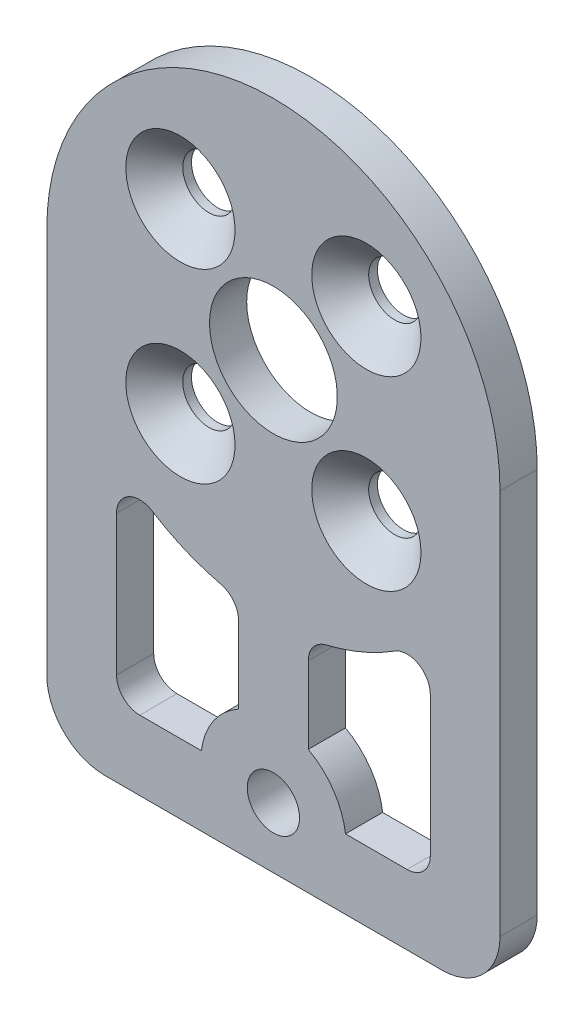
ISO-10303-21;
HEADER;
FILE_DESCRIPTION(('STEP AP214'),'2;1');
FILE_NAME('part.step','',(''),(''),'','','');
FILE_SCHEMA(('AUTOMOTIVE_DESIGN { 1 0 10303 214 1 1 1 1 }'));
ENDSEC;
DATA;
#1=APPLICATION_CONTEXT('core data for automotive mechanical design processes');
#2=APPLICATION_PROTOCOL_DEFINITION('international standard','automotive_design',2000,#1);
#3=PRODUCT_CONTEXT('',#1,'mechanical');
#4=PRODUCT('Part','Part','',(#3));
#5=PRODUCT_RELATED_PRODUCT_CATEGORY('part','',(#4));
#6=PRODUCT_DEFINITION_FORMATION('','',#4);
#7=PRODUCT_DEFINITION_CONTEXT('part definition',#1,'design');
#8=PRODUCT_DEFINITION('design','',#6,#7);
#9=PRODUCT_DEFINITION_SHAPE('','',#8);
#10=(LENGTH_UNIT() NAMED_UNIT(*) SI_UNIT(.MILLI.,.METRE.));
#11=(NAMED_UNIT(*) PLANE_ANGLE_UNIT() SI_UNIT($,.RADIAN.));
#12=(NAMED_UNIT(*) SI_UNIT($,.STERADIAN.) SOLID_ANGLE_UNIT());
#13=UNCERTAINTY_MEASURE_WITH_UNIT(LENGTH_MEASURE(1.E-05),#10,'distance_accuracy_value','');
#14=(GEOMETRIC_REPRESENTATION_CONTEXT(3) GLOBAL_UNCERTAINTY_ASSIGNED_CONTEXT((#13)) GLOBAL_UNIT_ASSIGNED_CONTEXT((#10,
#11,#12)) REPRESENTATION_CONTEXT('',''));
#15=CARTESIAN_POINT('',(0.,0.,0.));
#16=DIRECTION('',(0.,0.,1.));
#17=DIRECTION('',(1.,0.,0.));
#18=AXIS2_PLACEMENT_3D('',#15,#16,#17);
#19=CARTESIAN_POINT('',(-7.99999999999997,-8.00000000000003,-34.2));
#20=DIRECTION('',(0.,0.,1.));
#21=DIRECTION('',(1.,0.,0.));
#22=AXIS2_PLACEMENT_3D('',#19,#20,#21);
#23=CYLINDRICAL_SURFACE('',#22,2.25);
#24=CARTESIAN_POINT('',(-7.99999999999997,-8.00000000000003,-34.2));
#25=DIRECTION('',(0.,0.,-1.));
#26=DIRECTION('',(-1.,0.,0.));
#27=AXIS2_PLACEMENT_3D('',#24,#25,#26);
#28=CIRCLE('',#27,2.25);
#29=CARTESIAN_POINT('',(-10.25,-8.00000000000003,-34.2));
#30=VERTEX_POINT('',#29);
#31=EDGE_CURVE('E283',#30,#30,#28,.T.);
#32=ORIENTED_EDGE('',*,*,#31,.T.);
#33=EDGE_LOOP('',(#32));
#34=FACE_BOUND('',#33,.T.);
#35=CARTESIAN_POINT('',(-7.99999999999997,-8.00000000000003,-33.45));
#36=DIRECTION('',(0.,0.,1.));
#37=DIRECTION('',(1.,0.,0.));
#38=AXIS2_PLACEMENT_3D('',#35,#36,#37);
#39=CIRCLE('',#38,2.24999999999999);
#40=CARTESIAN_POINT('',(-5.74999999999999,-8.00000000000003,-33.45));
#41=VERTEX_POINT('',#40);
#42=EDGE_CURVE('E421',#41,#41,#39,.T.);
#43=ORIENTED_EDGE('',*,*,#42,.T.);
#44=EDGE_LOOP('',(#43));
#45=FACE_BOUND('',#44,.T.);
#46=ADVANCED_FACE('F42',(#34,#45),#23,.F.);
#47=CARTESIAN_POINT('',(8.,-8.,-34.2));
#48=DIRECTION('',(0.,0.,1.));
#49=DIRECTION('',(1.,0.,0.));
#50=AXIS2_PLACEMENT_3D('',#47,#48,#49);
#51=CYLINDRICAL_SURFACE('',#50,2.25);
#52=CARTESIAN_POINT('',(8.,-8.,-34.2));
#53=DIRECTION('',(0.,0.,-1.));
#54=DIRECTION('',(-1.,0.,0.));
#55=AXIS2_PLACEMENT_3D('',#52,#53,#54);
#56=CIRCLE('',#55,2.25);
#57=CARTESIAN_POINT('',(5.75,-8.,-34.2));
#58=VERTEX_POINT('',#57);
#59=EDGE_CURVE('E278',#58,#58,#56,.T.);
#60=ORIENTED_EDGE('',*,*,#59,.T.);
#61=EDGE_LOOP('',(#60));
#62=FACE_BOUND('',#61,.T.);
#63=CARTESIAN_POINT('',(8.,-8.,-33.45));
#64=DIRECTION('',(0.,0.,1.));
#65=DIRECTION('',(1.,0.,0.));
#66=AXIS2_PLACEMENT_3D('',#63,#64,#65);
#67=CIRCLE('',#66,2.24999999999999);
#68=CARTESIAN_POINT('',(10.25,-8.,-33.45));
#69=VERTEX_POINT('',#68);
#70=EDGE_CURVE('E415',#69,#69,#67,.T.);
#71=ORIENTED_EDGE('',*,*,#70,.T.);
#72=EDGE_LOOP('',(#71));
#73=FACE_BOUND('',#72,.T.);
#74=ADVANCED_FACE('F454',(#62,#73),#51,.F.);
#75=CARTESIAN_POINT('',(7.99999999999992,8.00000000000009,-34.2));
#76=DIRECTION('',(0.,0.,1.));
#77=DIRECTION('',(1.,0.,0.));
#78=AXIS2_PLACEMENT_3D('',#75,#76,#77);
#79=CYLINDRICAL_SURFACE('',#78,2.25);
#80=CARTESIAN_POINT('',(7.99999999999992,8.00000000000009,-34.2));
#81=DIRECTION('',(0.,0.,-1.));
#82=DIRECTION('',(-1.,0.,0.));
#83=AXIS2_PLACEMENT_3D('',#80,#81,#82);
#84=CIRCLE('',#83,2.25);
#85=CARTESIAN_POINT('',(5.74999999999992,8.00000000000009,-34.2));
#86=VERTEX_POINT('',#85);
#87=EDGE_CURVE('E271',#86,#86,#84,.T.);
#88=ORIENTED_EDGE('',*,*,#87,.T.);
#89=EDGE_LOOP('',(#88));
#90=FACE_BOUND('',#89,.T.);
#91=CARTESIAN_POINT('',(7.99999999999992,8.00000000000009,-33.45));
#92=DIRECTION('',(0.,0.,1.));
#93=DIRECTION('',(1.,0.,0.));
#94=AXIS2_PLACEMENT_3D('',#91,#92,#93);
#95=CIRCLE('',#94,2.24999999999999);
#96=CARTESIAN_POINT('',(10.2499999999999,8.00000000000009,-33.45));
#97=VERTEX_POINT('',#96);
#98=EDGE_CURVE('E409',#97,#97,#95,.T.);
#99=ORIENTED_EDGE('',*,*,#98,.T.);
#100=EDGE_LOOP('',(#99));
#101=FACE_BOUND('',#100,.T.);
#102=ADVANCED_FACE('F460',(#90,#101),#79,.F.);
#103=CARTESIAN_POINT('',(-8.,8.,-34.2));
#104=DIRECTION('',(0.,0.,1.));
#105=DIRECTION('',(1.,0.,0.));
#106=AXIS2_PLACEMENT_3D('',#103,#104,#105);
#107=CYLINDRICAL_SURFACE('',#106,2.25);
#108=CARTESIAN_POINT('',(-8.,8.,-34.2));
#109=DIRECTION('',(0.,0.,-1.));
#110=DIRECTION('',(-1.,0.,0.));
#111=AXIS2_PLACEMENT_3D('',#108,#109,#110);
#112=CIRCLE('',#111,2.25);
#113=CARTESIAN_POINT('',(-10.25,8.,-34.2));
#114=VERTEX_POINT('',#113);
#115=EDGE_CURVE('E286',#114,#114,#112,.T.);
#116=ORIENTED_EDGE('',*,*,#115,.T.);
#117=EDGE_LOOP('',(#116));
#118=FACE_BOUND('',#117,.T.);
#119=CARTESIAN_POINT('',(-8.,8.,-33.45));
#120=DIRECTION('',(0.,0.,1.));
#121=DIRECTION('',(1.,0.,0.));
#122=AXIS2_PLACEMENT_3D('',#119,#120,#121);
#123=CIRCLE('',#122,2.24999999999999);
#124=CARTESIAN_POINT('',(-5.75000000000002,8.,-33.45));
#125=VERTEX_POINT('',#124);
#126=EDGE_CURVE('E255',#125,#125,#123,.T.);
#127=ORIENTED_EDGE('',*,*,#126,.T.);
#128=EDGE_LOOP('',(#127));
#129=FACE_BOUND('',#128,.T.);
#130=ADVANCED_FACE('F432',(#118,#129),#107,.F.);
#131=CARTESIAN_POINT('',(0.,0.,-31.));
#132=DIRECTION('',(0.,0.,-1.));
#133=DIRECTION('',(-1.,0.,0.));
#134=AXIS2_PLACEMENT_3D('',#131,#132,#133);
#135=PLANE('',#134);
#136=CARTESIAN_POINT('',(-7.99999999999997,-8.00000000000003,-31.));
#137=DIRECTION('',(0.,0.,1.));
#138=DIRECTION('',(1.,0.,0.));
#139=AXIS2_PLACEMENT_3D('',#136,#137,#138);
#140=CIRCLE('',#139,4.7);
#141=CARTESIAN_POINT('',(-3.29999999999997,-8.00000000000003,-31.));
#142=VERTEX_POINT('',#141);
#143=EDGE_CURVE('E424',#142,#142,#140,.T.);
#144=ORIENTED_EDGE('',*,*,#143,.F.);
#145=EDGE_LOOP('',(#144));
#146=FACE_BOUND('',#145,.T.);
#147=CARTESIAN_POINT('',(8.,-8.,-31.));
#148=DIRECTION('',(0.,0.,1.));
#149=DIRECTION('',(1.,0.,0.));
#150=AXIS2_PLACEMENT_3D('',#147,#148,#149);
#151=CIRCLE('',#150,4.7);
#152=CARTESIAN_POINT('',(12.7,-8.,-31.));
#153=VERTEX_POINT('',#152);
#154=EDGE_CURVE('E418',#153,#153,#151,.T.);
#155=ORIENTED_EDGE('',*,*,#154,.F.);
#156=EDGE_LOOP('',(#155));
#157=FACE_BOUND('',#156,.T.);
#158=CARTESIAN_POINT('',(7.99999999999992,8.00000000000009,-31.));
#159=DIRECTION('',(0.,0.,1.));
#160=DIRECTION('',(1.,0.,0.));
#161=AXIS2_PLACEMENT_3D('',#158,#159,#160);
#162=CIRCLE('',#161,4.7);
#163=CARTESIAN_POINT('',(12.6999999999999,8.00000000000009,-31.));
#164=VERTEX_POINT('',#163);
#165=EDGE_CURVE('E412',#164,#164,#162,.T.);
#166=ORIENTED_EDGE('',*,*,#165,.F.);
#167=EDGE_LOOP('',(#166));
#168=FACE_BOUND('',#167,.T.);
#169=DIRECTION('',(0.,-1.,0.));
#170=VECTOR('',#169,1.);
#171=CARTESIAN_POINT('',(2.99999999999998,0.,-31.));
#172=LINE('',#171,#170);
#173=CARTESIAN_POINT('',(2.99999999999998,-20.9105236663265,-31.));
#174=VERTEX_POINT('',#173);
#175=CARTESIAN_POINT('',(2.99999999999998,-27.5170719501347,-31.));
#176=VERTEX_POINT('',#175);
#177=EDGE_CURVE('E227',#174,#176,#172,.T.);
#178=ORIENTED_EDGE('',*,*,#177,.F.);
#179=CARTESIAN_POINT('',(4.99999999999998,-20.9105236663265,-31.));
#180=DIRECTION('',(0.,0.,-1.));
#181=DIRECTION('',(-1.,0.,0.));
#182=AXIS2_PLACEMENT_3D('',#179,#180,#181);
#183=CIRCLE('',#182,2.);
#184=CARTESIAN_POINT('',(4.53488372093022,-18.9653586741101,-31.));
#185=VERTEX_POINT('',#184);
#186=EDGE_CURVE('E369',#174,#185,#183,.T.);
#187=ORIENTED_EDGE('',*,*,#186,.T.);
#188=CARTESIAN_POINT('',(0.,0.,-31.));
#189=DIRECTION('',(0.,0.,1.));
#190=DIRECTION('',(1.,0.,0.));
#191=AXIS2_PLACEMENT_3D('',#188,#189,#190);
#192=CIRCLE('',#191,19.5);
#193=CARTESIAN_POINT('',(10.4302325581395,-16.4760507641584,-31.));
#194=VERTEX_POINT('',#193);
#195=EDGE_CURVE('E224',#185,#194,#192,.T.);
#196=ORIENTED_EDGE('',*,*,#195,.T.);
#197=CARTESIAN_POINT('',(11.5,-18.1659021245849,-31.));
#198=DIRECTION('',(0.,0.,-1.));
#199=DIRECTION('',(-1.,0.,0.));
#200=AXIS2_PLACEMENT_3D('',#197,#198,#199);
#201=CIRCLE('',#200,2.);
#202=CARTESIAN_POINT('',(13.5,-18.1659021245849,-31.));
#203=VERTEX_POINT('',#202);
#204=EDGE_CURVE('E50',#194,#203,#201,.T.);
#205=ORIENTED_EDGE('',*,*,#204,.T.);
#206=DIRECTION('',(0.,1.,0.));
#207=VECTOR('',#206,1.);
#208=CARTESIAN_POINT('',(13.5,0.,-31.));
#209=LINE('',#208,#207);
#210=CARTESIAN_POINT('',(13.5,-30.2157287525381,-31.));
#211=VERTEX_POINT('',#210);
#212=EDGE_CURVE('E233',#211,#203,#209,.T.);
#213=ORIENTED_EDGE('',*,*,#212,.F.);
#214=CARTESIAN_POINT('',(11.5,-30.2157287525381,-31.));
#215=DIRECTION('',(0.,0.,-1.));
#216=DIRECTION('',(-1.,0.,0.));
#217=AXIS2_PLACEMENT_3D('',#214,#215,#216);
#218=CIRCLE('',#217,2.);
#219=CARTESIAN_POINT('',(11.5,-32.2157287525381,-31.));
#220=VERTEX_POINT('',#219);
#221=EDGE_CURVE('E373',#211,#220,#218,.T.);
#222=ORIENTED_EDGE('',*,*,#221,.T.);
#223=DIRECTION('',(1.,0.,0.));
#224=VECTOR('',#223,1.);
#225=CARTESIAN_POINT('',(0.,-32.2157287525381,-31.));
#226=LINE('',#225,#224);
#227=CARTESIAN_POINT('',(6.20059824616984,-32.2157287525381,-31.));
#228=VERTEX_POINT('',#227);
#229=EDGE_CURVE('E231',#228,#220,#226,.T.);
#230=ORIENTED_EDGE('',*,*,#229,.F.);
#231=CARTESIAN_POINT('',(0.,-33.,-31.));
#232=DIRECTION('',(0.,0.,1.));
#233=DIRECTION('',(1.,0.,0.));
#234=AXIS2_PLACEMENT_3D('',#231,#232,#233);
#235=CIRCLE('',#234,6.25);
#236=EDGE_CURVE('E198',#176,#228,#235,.F.);
#237=ORIENTED_EDGE('',*,*,#236,.F.);
#238=EDGE_LOOP('',(#178,#187,#196,#205,#213,#222,#230,#237));
#239=FACE_BOUND('',#238,.T.);
#240=CARTESIAN_POINT('',(0.,0.,-31.));
#241=DIRECTION('',(0.,0.,-1.));
#242=DIRECTION('',(-1.,0.,0.));
#243=AXIS2_PLACEMENT_3D('',#240,#241,#242);
#244=CIRCLE('',#243,5.5);
#245=CARTESIAN_POINT('',(-5.5,0.,-31.));
#246=VERTEX_POINT('',#245);
#247=EDGE_CURVE('E274',#246,#246,#244,.T.);
#248=ORIENTED_EDGE('',*,*,#247,.T.);
#249=EDGE_LOOP('',(#248));
#250=FACE_BOUND('',#249,.T.);
#251=DIRECTION('',(-1.,0.,0.));
#252=VECTOR('',#251,1.);
#253=CARTESIAN_POINT('',(19.5,-38.2157287525381,-31.));
#254=LINE('',#253,#252);
#255=CARTESIAN_POINT('',(14.5,-38.2157287525381,-31.));
#256=VERTEX_POINT('',#255);
#257=CARTESIAN_POINT('',(-14.5,-38.2157287525381,-31.));
#258=VERTEX_POINT('',#257);
#259=EDGE_CURVE('E308',#256,#258,#254,.T.);
#260=ORIENTED_EDGE('',*,*,#259,.F.);
#261=CARTESIAN_POINT('',(14.5,-33.2157287525381,-31.));
#262=DIRECTION('',(0.,0.,-1.));
#263=DIRECTION('',(-1.,0.,0.));
#264=AXIS2_PLACEMENT_3D('',#261,#262,#263);
#265=CIRCLE('',#264,5.);
#266=CARTESIAN_POINT('',(19.5,-33.2157287525381,-31.));
#267=VERTEX_POINT('',#266);
#268=EDGE_CURVE('E326',#256,#267,#265,.F.);
#269=ORIENTED_EDGE('',*,*,#268,.T.);
#270=DIRECTION('',(0.,-1.,0.));
#271=VECTOR('',#270,1.);
#272=CARTESIAN_POINT('',(19.5,0.,-31.));
#273=LINE('',#272,#271);
#274=CARTESIAN_POINT('',(19.5,0.,-31.));
#275=VERTEX_POINT('',#274);
#276=EDGE_CURVE('E305',#275,#267,#273,.T.);
#277=ORIENTED_EDGE('',*,*,#276,.F.);
#278=CARTESIAN_POINT('',(0.,0.,-31.));
#279=DIRECTION('',(0.,0.,-1.));
#280=DIRECTION('',(-1.,0.,0.));
#281=AXIS2_PLACEMENT_3D('',#278,#279,#280);
#282=CIRCLE('',#281,19.5);
#283=CARTESIAN_POINT('',(-19.5,0.,-31.));
#284=VERTEX_POINT('',#283);
#285=EDGE_CURVE('E289',#284,#275,#282,.T.);
#286=ORIENTED_EDGE('',*,*,#285,.F.);
#287=DIRECTION('',(0.,1.,0.));
#288=VECTOR('',#287,1.);
#289=CARTESIAN_POINT('',(-19.5,-38.2157287525381,-31.));
#290=LINE('',#289,#288);
#291=CARTESIAN_POINT('',(-19.5,-33.2157287525381,-31.));
#292=VERTEX_POINT('',#291);
#293=EDGE_CURVE('E294',#292,#284,#290,.T.);
#294=ORIENTED_EDGE('',*,*,#293,.F.);
#295=CARTESIAN_POINT('',(-14.5,-33.2157287525381,-31.));
#296=DIRECTION('',(0.,0.,-1.));
#297=DIRECTION('',(-1.,0.,0.));
#298=AXIS2_PLACEMENT_3D('',#295,#296,#297);
#299=CIRCLE('',#298,5.);
#300=EDGE_CURVE('E324',#292,#258,#299,.F.);
#301=ORIENTED_EDGE('',*,*,#300,.T.);
#302=EDGE_LOOP('',(#260,#269,#277,#286,#294,#301));
#303=FACE_BOUND('',#302,.T.);
#304=CARTESIAN_POINT('',(0.,-33.,-31.));
#305=DIRECTION('',(0.,0.,-1.));
#306=DIRECTION('',(-1.,0.,0.));
#307=AXIS2_PLACEMENT_3D('',#304,#305,#306);
#308=CIRCLE('',#307,2.25);
#309=CARTESIAN_POINT('',(-2.25000000000001,-33.,-31.));
#310=VERTEX_POINT('',#309);
#311=EDGE_CURVE('E202',#310,#310,#308,.T.);
#312=ORIENTED_EDGE('',*,*,#311,.T.);
#313=EDGE_LOOP('',(#312));
#314=FACE_BOUND('',#313,.T.);
#315=DIRECTION('',(0.,-1.,0.));
#316=VECTOR('',#315,1.);
#317=CARTESIAN_POINT('',(-13.5,0.,-31.));
#318=LINE('',#317,#316);
#319=CARTESIAN_POINT('',(-13.5,-18.1659021245849,-31.));
#320=VERTEX_POINT('',#319);
#321=CARTESIAN_POINT('',(-13.5,-30.2157287525381,-31.));
#322=VERTEX_POINT('',#321);
#323=EDGE_CURVE('E254',#320,#322,#318,.T.);
#324=ORIENTED_EDGE('',*,*,#323,.F.);
#325=CARTESIAN_POINT('',(-11.5,-18.1659021245849,-31.));
#326=DIRECTION('',(0.,0.,-1.));
#327=DIRECTION('',(-1.,0.,0.));
#328=AXIS2_PLACEMENT_3D('',#325,#326,#327);
#329=CIRCLE('',#328,2.);
#330=CARTESIAN_POINT('',(-10.4302325581395,-16.4760507641584,-31.));
#331=VERTEX_POINT('',#330);
#332=EDGE_CURVE('E380',#320,#331,#329,.T.);
#333=ORIENTED_EDGE('',*,*,#332,.T.);
#334=CARTESIAN_POINT('',(0.,0.,-31.));
#335=DIRECTION('',(0.,0.,1.));
#336=DIRECTION('',(1.,0.,0.));
#337=AXIS2_PLACEMENT_3D('',#334,#335,#336);
#338=CIRCLE('',#337,19.5);
#339=CARTESIAN_POINT('',(-4.53488372093023,-18.9653586741101,-31.));
#340=VERTEX_POINT('',#339);
#341=EDGE_CURVE('E252',#331,#340,#338,.T.);
#342=ORIENTED_EDGE('',*,*,#341,.T.);
#343=CARTESIAN_POINT('',(-5.,-20.9105236663265,-31.));
#344=DIRECTION('',(0.,0.,-1.));
#345=DIRECTION('',(-1.,0.,0.));
#346=AXIS2_PLACEMENT_3D('',#343,#344,#345);
#347=CIRCLE('',#346,2.);
#348=CARTESIAN_POINT('',(-3.,-20.9105236663265,-31.));
#349=VERTEX_POINT('',#348);
#350=EDGE_CURVE('E65',#340,#349,#347,.T.);
#351=ORIENTED_EDGE('',*,*,#350,.T.);
#352=DIRECTION('',(0.,-1.,0.));
#353=VECTOR('',#352,1.);
#354=CARTESIAN_POINT('',(-3.,0.,-31.));
#355=LINE('',#354,#353);
#356=CARTESIAN_POINT('',(-3.,-27.5170719501347,-31.));
#357=VERTEX_POINT('',#356);
#358=EDGE_CURVE('E241',#349,#357,#355,.T.);
#359=ORIENTED_EDGE('',*,*,#358,.T.);
#360=CARTESIAN_POINT('',(0.,-33.,-31.));
#361=DIRECTION('',(0.,0.,1.));
#362=DIRECTION('',(1.,0.,0.));
#363=AXIS2_PLACEMENT_3D('',#360,#361,#362);
#364=CIRCLE('',#363,6.25);
#365=CARTESIAN_POINT('',(-6.20059824616985,-32.2157287525381,-31.));
#366=VERTEX_POINT('',#365);
#367=EDGE_CURVE('E260',#366,#357,#364,.F.);
#368=ORIENTED_EDGE('',*,*,#367,.F.);
#369=DIRECTION('',(1.,0.,0.));
#370=VECTOR('',#369,1.);
#371=CARTESIAN_POINT('',(0.,-32.2157287525381,-31.));
#372=LINE('',#371,#370);
#373=CARTESIAN_POINT('',(-11.5,-32.2157287525381,-31.));
#374=VERTEX_POINT('',#373);
#375=EDGE_CURVE('E258',#374,#366,#372,.T.);
#376=ORIENTED_EDGE('',*,*,#375,.F.);
#377=CARTESIAN_POINT('',(-11.5,-30.2157287525381,-31.));
#378=DIRECTION('',(0.,0.,-1.));
#379=DIRECTION('',(-1.,0.,0.));
#380=AXIS2_PLACEMENT_3D('',#377,#378,#379);
#381=CIRCLE('',#380,2.);
#382=EDGE_CURVE('E365',#374,#322,#381,.T.);
#383=ORIENTED_EDGE('',*,*,#382,.T.);
#384=EDGE_LOOP('',(#324,#333,#342,#351,#359,#368,#376,#383));
#385=FACE_BOUND('',#384,.T.);
#386=CARTESIAN_POINT('',(-8.,8.,-31.));
#387=DIRECTION('',(0.,0.,1.));
#388=DIRECTION('',(1.,0.,0.));
#389=AXIS2_PLACEMENT_3D('',#386,#387,#388);
#390=CIRCLE('',#389,4.7);
#391=CARTESIAN_POINT('',(-3.3,8.,-31.));
#392=VERTEX_POINT('',#391);
#393=EDGE_CURVE('E406',#392,#392,#390,.T.);
#394=ORIENTED_EDGE('',*,*,#393,.F.);
#395=EDGE_LOOP('',(#394));
#396=FACE_BOUND('',#395,.T.);
#397=ADVANCED_FACE('F386',(#146,#157,#168,#239,#250,#303,#314,#385,#396),#135,.F.);
#398=CARTESIAN_POINT('',(0.,0.,-34.2));
#399=DIRECTION('',(0.,0.,-1.));
#400=DIRECTION('',(-1.,0.,0.));
#401=AXIS2_PLACEMENT_3D('',#398,#399,#400);
#402=PLANE('',#401);
#403=CARTESIAN_POINT('',(0.,-33.,-34.2));
#404=DIRECTION('',(0.,0.,-1.));
#405=DIRECTION('',(-1.,0.,0.));
#406=AXIS2_PLACEMENT_3D('',#403,#404,#405);
#407=CIRCLE('',#406,2.25);
#408=CARTESIAN_POINT('',(-2.25000000000001,-33.,-34.2));
#409=VERTEX_POINT('',#408);
#410=EDGE_CURVE('E268',#409,#409,#407,.T.);
#411=ORIENTED_EDGE('',*,*,#410,.F.);
#412=EDGE_LOOP('',(#411));
#413=FACE_BOUND('',#412,.T.);
#414=CARTESIAN_POINT('',(0.,0.,-34.2));
#415=DIRECTION('',(0.,0.,-1.));
#416=DIRECTION('',(-1.,0.,0.));
#417=AXIS2_PLACEMENT_3D('',#414,#415,#416);
#418=CIRCLE('',#417,5.5);
#419=CARTESIAN_POINT('',(-5.5,0.,-34.2));
#420=VERTEX_POINT('',#419);
#421=EDGE_CURVE('E275',#420,#420,#418,.T.);
#422=ORIENTED_EDGE('',*,*,#421,.F.);
#423=EDGE_LOOP('',(#422));
#424=FACE_BOUND('',#423,.T.);
#425=ORIENTED_EDGE('',*,*,#31,.F.);
#426=EDGE_LOOP('',(#425));
#427=FACE_BOUND('',#426,.T.);
#428=DIRECTION('',(0.,-1.,0.));
#429=VECTOR('',#428,1.);
#430=CARTESIAN_POINT('',(19.5,0.,-34.2));
#431=LINE('',#430,#429);
#432=CARTESIAN_POINT('',(19.5,0.,-34.2));
#433=VERTEX_POINT('',#432);
#434=CARTESIAN_POINT('',(19.5,-33.2157287525381,-34.2));
#435=VERTEX_POINT('',#434);
#436=EDGE_CURVE('E293',#433,#435,#431,.T.);
#437=ORIENTED_EDGE('',*,*,#436,.T.);
#438=CARTESIAN_POINT('',(14.5,-33.2157287525381,-34.2));
#439=DIRECTION('',(0.,0.,-1.));
#440=DIRECTION('',(-1.,0.,0.));
#441=AXIS2_PLACEMENT_3D('',#438,#439,#440);
#442=CIRCLE('',#441,5.);
#443=CARTESIAN_POINT('',(14.5,-38.2157287525381,-34.2));
#444=VERTEX_POINT('',#443);
#445=EDGE_CURVE('E332',#435,#444,#442,.T.);
#446=ORIENTED_EDGE('',*,*,#445,.T.);
#447=DIRECTION('',(-1.,0.,0.));
#448=VECTOR('',#447,1.);
#449=CARTESIAN_POINT('',(19.5,-38.2157287525381,-34.2));
#450=LINE('',#449,#448);
#451=CARTESIAN_POINT('',(-14.5,-38.2157287525381,-34.2));
#452=VERTEX_POINT('',#451);
#453=EDGE_CURVE('E297',#444,#452,#450,.T.);
#454=ORIENTED_EDGE('',*,*,#453,.T.);
#455=CARTESIAN_POINT('',(-14.5,-33.2157287525381,-34.2));
#456=DIRECTION('',(0.,0.,-1.));
#457=DIRECTION('',(-1.,0.,0.));
#458=AXIS2_PLACEMENT_3D('',#455,#456,#457);
#459=CIRCLE('',#458,5.);
#460=CARTESIAN_POINT('',(-19.5,-33.2157287525381,-34.2));
#461=VERTEX_POINT('',#460);
#462=EDGE_CURVE('E330',#452,#461,#459,.T.);
#463=ORIENTED_EDGE('',*,*,#462,.T.);
#464=DIRECTION('',(0.,1.,0.));
#465=VECTOR('',#464,1.);
#466=CARTESIAN_POINT('',(-19.5,-38.2157287525381,-34.2));
#467=LINE('',#466,#465);
#468=CARTESIAN_POINT('',(-19.5,0.,-34.2));
#469=VERTEX_POINT('',#468);
#470=EDGE_CURVE('E300',#461,#469,#467,.T.);
#471=ORIENTED_EDGE('',*,*,#470,.T.);
#472=CARTESIAN_POINT('',(0.,0.,-34.2));
#473=DIRECTION('',(0.,0.,-1.));
#474=DIRECTION('',(-1.,0.,0.));
#475=AXIS2_PLACEMENT_3D('',#472,#473,#474);
#476=CIRCLE('',#475,19.5);
#477=EDGE_CURVE('E290',#469,#433,#476,.T.);
#478=ORIENTED_EDGE('',*,*,#477,.T.);
#479=EDGE_LOOP('',(#437,#446,#454,#463,#471,#478));
#480=FACE_BOUND('',#479,.T.);
#481=ORIENTED_EDGE('',*,*,#115,.F.);
#482=EDGE_LOOP('',(#481));
#483=FACE_BOUND('',#482,.T.);
#484=ORIENTED_EDGE('',*,*,#59,.F.);
#485=EDGE_LOOP('',(#484));
#486=FACE_BOUND('',#485,.T.);
#487=ORIENTED_EDGE('',*,*,#87,.F.);
#488=EDGE_LOOP('',(#487));
#489=FACE_BOUND('',#488,.T.);
#490=DIRECTION('',(0.,-1.,0.));
#491=VECTOR('',#490,1.);
#492=CARTESIAN_POINT('',(-3.,0.,-34.2));
#493=LINE('',#492,#491);
#494=CARTESIAN_POINT('',(-3.,-20.9105236663265,-34.2));
#495=VERTEX_POINT('',#494);
#496=CARTESIAN_POINT('',(-3.,-27.5170719501347,-34.2));
#497=VERTEX_POINT('',#496);
#498=EDGE_CURVE('E249',#495,#497,#493,.T.);
#499=ORIENTED_EDGE('',*,*,#498,.F.);
#500=CARTESIAN_POINT('',(-5.,-20.9105236663265,-34.2));
#501=DIRECTION('',(0.,0.,-1.));
#502=DIRECTION('',(-1.,0.,0.));
#503=AXIS2_PLACEMENT_3D('',#500,#501,#502);
#504=CIRCLE('',#503,2.);
#505=CARTESIAN_POINT('',(-4.53488372093023,-18.9653586741101,-34.2));
#506=VERTEX_POINT('',#505);
#507=EDGE_CURVE('E378',#495,#506,#504,.F.);
#508=ORIENTED_EDGE('',*,*,#507,.T.);
#509=CARTESIAN_POINT('',(0.,0.,-34.2));
#510=DIRECTION('',(0.,0.,1.));
#511=DIRECTION('',(1.,0.,0.));
#512=AXIS2_PLACEMENT_3D('',#509,#510,#511);
#513=CIRCLE('',#512,19.5);
#514=CARTESIAN_POINT('',(-10.4302325581395,-16.4760507641584,-34.2));
#515=VERTEX_POINT('',#514);
#516=EDGE_CURVE('E237',#515,#506,#513,.T.);
#517=ORIENTED_EDGE('',*,*,#516,.F.);
#518=CARTESIAN_POINT('',(-11.5,-18.1659021245849,-34.2));
#519=DIRECTION('',(0.,0.,-1.));
#520=DIRECTION('',(-1.,0.,0.));
#521=AXIS2_PLACEMENT_3D('',#518,#519,#520);
#522=CIRCLE('',#521,2.);
#523=CARTESIAN_POINT('',(-13.5,-18.1659021245849,-34.2));
#524=VERTEX_POINT('',#523);
#525=EDGE_CURVE('E382',#515,#524,#522,.F.);
#526=ORIENTED_EDGE('',*,*,#525,.T.);
#527=DIRECTION('',(0.,-1.,0.));
#528=VECTOR('',#527,1.);
#529=CARTESIAN_POINT('',(-13.5,0.,-34.2));
#530=LINE('',#529,#528);
#531=CARTESIAN_POINT('',(-13.5,-30.2157287525381,-34.2));
#532=VERTEX_POINT('',#531);
#533=EDGE_CURVE('E240',#524,#532,#530,.T.);
#534=ORIENTED_EDGE('',*,*,#533,.T.);
#535=CARTESIAN_POINT('',(-11.5,-30.2157287525381,-34.2));
#536=DIRECTION('',(0.,0.,-1.));
#537=DIRECTION('',(-1.,0.,0.));
#538=AXIS2_PLACEMENT_3D('',#535,#536,#537);
#539=CIRCLE('',#538,2.);
#540=CARTESIAN_POINT('',(-11.5,-32.2157287525381,-34.2));
#541=VERTEX_POINT('',#540);
#542=EDGE_CURVE('E367',#532,#541,#539,.F.);
#543=ORIENTED_EDGE('',*,*,#542,.T.);
#544=DIRECTION('',(1.,0.,0.));
#545=VECTOR('',#544,1.);
#546=CARTESIAN_POINT('',(0.,-32.2157287525381,-34.2));
#547=LINE('',#546,#545);
#548=CARTESIAN_POINT('',(-6.20059824616985,-32.2157287525381,-34.2));
#549=VERTEX_POINT('',#548);
#550=EDGE_CURVE('E244',#541,#549,#547,.T.);
#551=ORIENTED_EDGE('',*,*,#550,.T.);
#552=CARTESIAN_POINT('',(0.,-33.,-34.2));
#553=DIRECTION('',(0.,0.,1.));
#554=DIRECTION('',(1.,0.,0.));
#555=AXIS2_PLACEMENT_3D('',#552,#553,#554);
#556=CIRCLE('',#555,6.25);
#557=EDGE_CURVE('E246',#549,#497,#556,.F.);
#558=ORIENTED_EDGE('',*,*,#557,.T.);
#559=EDGE_LOOP('',(#499,#508,#517,#526,#534,#543,#551,#558));
#560=FACE_BOUND('',#559,.T.);
#561=DIRECTION('',(1.,0.,0.));
#562=VECTOR('',#561,1.);
#563=CARTESIAN_POINT('',(0.,-32.2157287525381,-34.2));
#564=LINE('',#563,#562);
#565=CARTESIAN_POINT('',(6.20059824616984,-32.2157287525381,-34.2));
#566=VERTEX_POINT('',#565);
#567=CARTESIAN_POINT('',(11.5,-32.2157287525381,-34.2));
#568=VERTEX_POINT('',#567);
#569=EDGE_CURVE('E206',#566,#568,#564,.T.);
#570=ORIENTED_EDGE('',*,*,#569,.T.);
#571=CARTESIAN_POINT('',(11.5,-30.2157287525381,-34.2));
#572=DIRECTION('',(0.,0.,-1.));
#573=DIRECTION('',(-1.,0.,0.));
#574=AXIS2_PLACEMENT_3D('',#571,#572,#573);
#575=CIRCLE('',#574,2.);
#576=CARTESIAN_POINT('',(13.5,-30.2157287525381,-34.2));
#577=VERTEX_POINT('',#576);
#578=EDGE_CURVE('E375',#568,#577,#575,.F.);
#579=ORIENTED_EDGE('',*,*,#578,.T.);
#580=DIRECTION('',(0.,1.,0.));
#581=VECTOR('',#580,1.);
#582=CARTESIAN_POINT('',(13.5,0.,-34.2));
#583=LINE('',#582,#581);
#584=CARTESIAN_POINT('',(13.5,-18.1659021245849,-34.2));
#585=VERTEX_POINT('',#584);
#586=EDGE_CURVE('E212',#577,#585,#583,.T.);
#587=ORIENTED_EDGE('',*,*,#586,.T.);
#588=CARTESIAN_POINT('',(11.5,-18.1659021245849,-34.2));
#589=DIRECTION('',(0.,0.,-1.));
#590=DIRECTION('',(-1.,0.,0.));
#591=AXIS2_PLACEMENT_3D('',#588,#589,#590);
#592=CIRCLE('',#591,2.);
#593=CARTESIAN_POINT('',(10.4302325581395,-16.4760507641584,-34.2));
#594=VERTEX_POINT('',#593);
#595=EDGE_CURVE('E11',#585,#594,#592,.F.);
#596=ORIENTED_EDGE('',*,*,#595,.T.);
#597=CARTESIAN_POINT('',(0.,0.,-34.2));
#598=DIRECTION('',(0.,0.,1.));
#599=DIRECTION('',(1.,0.,0.));
#600=AXIS2_PLACEMENT_3D('',#597,#598,#599);
#601=CIRCLE('',#600,19.5);
#602=CARTESIAN_POINT('',(4.53488372093022,-18.9653586741101,-34.2));
#603=VERTEX_POINT('',#602);
#604=EDGE_CURVE('E218',#603,#594,#601,.T.);
#605=ORIENTED_EDGE('',*,*,#604,.F.);
#606=CARTESIAN_POINT('',(4.99999999999998,-20.9105236663265,-34.2));
#607=DIRECTION('',(0.,0.,-1.));
#608=DIRECTION('',(-1.,0.,0.));
#609=AXIS2_PLACEMENT_3D('',#606,#607,#608);
#610=CIRCLE('',#609,2.);
#611=CARTESIAN_POINT('',(2.99999999999998,-20.9105236663265,-34.2));
#612=VERTEX_POINT('',#611);
#613=EDGE_CURVE('E371',#603,#612,#610,.F.);
#614=ORIENTED_EDGE('',*,*,#613,.T.);
#615=DIRECTION('',(0.,-1.,0.));
#616=VECTOR('',#615,1.);
#617=CARTESIAN_POINT('',(2.99999999999998,0.,-34.2));
#618=LINE('',#617,#616);
#619=CARTESIAN_POINT('',(2.99999999999998,-27.5170719501347,-34.2));
#620=VERTEX_POINT('',#619);
#621=EDGE_CURVE('E216',#612,#620,#618,.T.);
#622=ORIENTED_EDGE('',*,*,#621,.T.);
#623=CARTESIAN_POINT('',(0.,-33.,-34.2));
#624=DIRECTION('',(0.,0.,1.));
#625=DIRECTION('',(1.,0.,0.));
#626=AXIS2_PLACEMENT_3D('',#623,#624,#625);
#627=CIRCLE('',#626,6.25);
#628=EDGE_CURVE('E195',#620,#566,#627,.F.);
#629=ORIENTED_EDGE('',*,*,#628,.T.);
#630=EDGE_LOOP('',(#570,#579,#587,#596,#605,#614,#622,#629));
#631=FACE_BOUND('',#630,.T.);
#632=ADVANCED_FACE('F214',(#413,#424,#427,#480,#483,#486,#489,#560,#631),#402,.T.);
#633=CARTESIAN_POINT('',(0.,0.,-34.2));
#634=DIRECTION('',(0.,0.,1.));
#635=DIRECTION('',(1.,0.,0.));
#636=AXIS2_PLACEMENT_3D('',#633,#634,#635);
#637=CYLINDRICAL_SURFACE('',#636,19.5);
#638=ORIENTED_EDGE('',*,*,#285,.T.);
#639=DIRECTION('',(0.,0.,1.));
#640=VECTOR('',#639,1.);
#641=CARTESIAN_POINT('',(19.5,0.,-34.2));
#642=LINE('',#641,#640);
#643=EDGE_CURVE('E314',#433,#275,#642,.T.);
#644=ORIENTED_EDGE('',*,*,#643,.F.);
#645=ORIENTED_EDGE('',*,*,#477,.F.);
#646=DIRECTION('',(0.,0.,1.));
#647=VECTOR('',#646,1.);
#648=CARTESIAN_POINT('',(-19.5,0.,-34.2));
#649=LINE('',#648,#647);
#650=EDGE_CURVE('E302',#469,#284,#649,.T.);
#651=ORIENTED_EDGE('',*,*,#650,.T.);
#652=EDGE_LOOP('',(#638,#644,#645,#651));
#653=FACE_BOUND('',#652,.T.);
#654=ADVANCED_FACE('F470',(#653),#637,.T.);
#655=CARTESIAN_POINT('',(19.5,0.,-34.2));
#656=DIRECTION('',(-1.,0.,0.));
#657=DIRECTION('',(0.,-1.,0.));
#658=AXIS2_PLACEMENT_3D('',#655,#656,#657);
#659=PLANE('',#658);
#660=ORIENTED_EDGE('',*,*,#276,.T.);
#661=DIRECTION('',(0.,0.,1.));
#662=VECTOR('',#661,1.);
#663=CARTESIAN_POINT('',(19.5,-33.2157287525381,-34.2));
#664=LINE('',#663,#662);
#665=EDGE_CURVE('E328',#267,#435,#664,.F.);
#666=ORIENTED_EDGE('',*,*,#665,.T.);
#667=ORIENTED_EDGE('',*,*,#436,.F.);
#668=ORIENTED_EDGE('',*,*,#643,.T.);
#669=EDGE_LOOP('',(#660,#666,#667,#668));
#670=FACE_BOUND('',#669,.T.);
#671=ADVANCED_FACE('F481',(#670),#659,.F.);
#672=CARTESIAN_POINT('',(19.5,-38.2157287525381,-34.2));
#673=DIRECTION('',(0.,1.,0.));
#674=DIRECTION('',(0.,0.,1.));
#675=AXIS2_PLACEMENT_3D('',#672,#673,#674);
#676=PLANE('',#675);
#677=ORIENTED_EDGE('',*,*,#453,.F.);
#678=DIRECTION('',(0.,0.,1.));
#679=VECTOR('',#678,1.);
#680=CARTESIAN_POINT('',(14.5,-38.2157287525381,-34.2));
#681=LINE('',#680,#679);
#682=EDGE_CURVE('E321',#444,#256,#681,.T.);
#683=ORIENTED_EDGE('',*,*,#682,.T.);
#684=ORIENTED_EDGE('',*,*,#259,.T.);
#685=DIRECTION('',(0.,0.,1.));
#686=VECTOR('',#685,1.);
#687=CARTESIAN_POINT('',(-14.5,-38.2157287525381,-34.2));
#688=LINE('',#687,#686);
#689=EDGE_CURVE('E317',#258,#452,#688,.F.);
#690=ORIENTED_EDGE('',*,*,#689,.T.);
#691=EDGE_LOOP('',(#677,#683,#684,#690));
#692=FACE_BOUND('',#691,.T.);
#693=ADVANCED_FACE('F477',(#692),#676,.F.);
#694=CARTESIAN_POINT('',(-19.5,-38.2157287525381,-34.2));
#695=DIRECTION('',(1.,0.,0.));
#696=DIRECTION('',(0.,0.,-1.));
#697=AXIS2_PLACEMENT_3D('',#694,#695,#696);
#698=PLANE('',#697);
#699=ORIENTED_EDGE('',*,*,#470,.F.);
#700=DIRECTION('',(0.,0.,1.));
#701=VECTOR('',#700,1.);
#702=CARTESIAN_POINT('',(-19.5,-33.2157287525381,-34.2));
#703=LINE('',#702,#701);
#704=EDGE_CURVE('E334',#461,#292,#703,.T.);
#705=ORIENTED_EDGE('',*,*,#704,.T.);
#706=ORIENTED_EDGE('',*,*,#293,.T.);
#707=ORIENTED_EDGE('',*,*,#650,.F.);
#708=EDGE_LOOP('',(#699,#705,#706,#707));
#709=FACE_BOUND('',#708,.T.);
#710=ADVANCED_FACE('F473',(#709),#698,.F.);
#711=CARTESIAN_POINT('',(0.,0.,-34.2));
#712=DIRECTION('',(0.,0.,1.));
#713=DIRECTION('',(1.,0.,0.));
#714=AXIS2_PLACEMENT_3D('',#711,#712,#713);
#715=CYLINDRICAL_SURFACE('',#714,5.5);
#716=ORIENTED_EDGE('',*,*,#421,.T.);
#717=EDGE_LOOP('',(#716));
#718=FACE_BOUND('',#717,.T.);
#719=ORIENTED_EDGE('',*,*,#247,.F.);
#720=EDGE_LOOP('',(#719));
#721=FACE_BOUND('',#720,.T.);
#722=ADVANCED_FACE('F476',(#718,#721),#715,.F.);
#723=CARTESIAN_POINT('',(0.,-33.,-50.2));
#724=DIRECTION('',(0.,0.,1.));
#725=DIRECTION('',(1.,0.,0.));
#726=AXIS2_PLACEMENT_3D('',#723,#724,#725);
#727=CYLINDRICAL_SURFACE('',#726,2.25);
#728=ORIENTED_EDGE('',*,*,#410,.T.);
#729=EDGE_LOOP('',(#728));
#730=FACE_BOUND('',#729,.T.);
#731=ORIENTED_EDGE('',*,*,#311,.F.);
#732=EDGE_LOOP('',(#731));
#733=FACE_BOUND('',#732,.T.);
#734=ADVANCED_FACE('F493',(#730,#733),#727,.F.);
#735=CARTESIAN_POINT('',(14.5,-33.2157287525381,-34.2));
#736=DIRECTION('',(0.,0.,1.));
#737=DIRECTION('',(1.,0.,0.));
#738=AXIS2_PLACEMENT_3D('',#735,#736,#737);
#739=CYLINDRICAL_SURFACE('',#738,5.);
#740=ORIENTED_EDGE('',*,*,#445,.F.);
#741=ORIENTED_EDGE('',*,*,#665,.F.);
#742=ORIENTED_EDGE('',*,*,#268,.F.);
#743=ORIENTED_EDGE('',*,*,#682,.F.);
#744=EDGE_LOOP('',(#740,#741,#742,#743));
#745=FACE_BOUND('',#744,.T.);
#746=ADVANCED_FACE('F489',(#745),#739,.T.);
#747=CARTESIAN_POINT('',(-14.5,-33.2157287525381,-34.2));
#748=DIRECTION('',(0.,0.,1.));
#749=DIRECTION('',(1.,0.,0.));
#750=AXIS2_PLACEMENT_3D('',#747,#748,#749);
#751=CYLINDRICAL_SURFACE('',#750,5.);
#752=ORIENTED_EDGE('',*,*,#462,.F.);
#753=ORIENTED_EDGE('',*,*,#689,.F.);
#754=ORIENTED_EDGE('',*,*,#300,.F.);
#755=ORIENTED_EDGE('',*,*,#704,.F.);
#756=EDGE_LOOP('',(#752,#753,#754,#755));
#757=FACE_BOUND('',#756,.T.);
#758=ADVANCED_FACE('F492',(#757),#751,.T.);
#759=CARTESIAN_POINT('',(0.,0.,-34.2));
#760=DIRECTION('',(0.,0.,1.));
#761=DIRECTION('',(1.,0.,0.));
#762=AXIS2_PLACEMENT_3D('',#759,#760,#761);
#763=CYLINDRICAL_SURFACE('',#762,19.5);
#764=ORIENTED_EDGE('',*,*,#516,.T.);
#765=DIRECTION('',(0.,0.,1.));
#766=VECTOR('',#765,1.);
#767=CARTESIAN_POINT('',(-4.53488372093023,-18.9653586741101,-34.2));
#768=LINE('',#767,#766);
#769=EDGE_CURVE('E361',#506,#340,#768,.T.);
#770=ORIENTED_EDGE('',*,*,#769,.T.);
#771=ORIENTED_EDGE('',*,*,#341,.F.);
#772=DIRECTION('',(0.,0.,1.));
#773=VECTOR('',#772,1.);
#774=CARTESIAN_POINT('',(-10.4302325581395,-16.4760507641584,-34.2));
#775=LINE('',#774,#773);
#776=EDGE_CURVE('E359',#331,#515,#775,.F.);
#777=ORIENTED_EDGE('',*,*,#776,.T.);
#778=EDGE_LOOP('',(#764,#770,#771,#777));
#779=FACE_BOUND('',#778,.T.);
#780=ADVANCED_FACE('F497',(#779),#763,.T.);
#781=CARTESIAN_POINT('',(-3.,0.,-34.2));
#782=DIRECTION('',(-1.,0.,0.));
#783=DIRECTION('',(0.,-1.,0.));
#784=AXIS2_PLACEMENT_3D('',#781,#782,#783);
#785=PLANE('',#784);
#786=ORIENTED_EDGE('',*,*,#358,.F.);
#787=DIRECTION('',(0.,0.,-1.));
#788=VECTOR('',#787,1.);
#789=CARTESIAN_POINT('',(-3.,-20.9105236663265,-34.2));
#790=LINE('',#789,#788);
#791=EDGE_CURVE('E57',#349,#495,#790,.T.);
#792=ORIENTED_EDGE('',*,*,#791,.T.);
#793=ORIENTED_EDGE('',*,*,#498,.T.);
#794=DIRECTION('',(0.,0.,1.));
#795=VECTOR('',#794,1.);
#796=CARTESIAN_POINT('',(-3.,-27.5170719501347,-34.2));
#797=LINE('',#796,#795);
#798=EDGE_CURVE('E228',#497,#357,#797,.T.);
#799=ORIENTED_EDGE('',*,*,#798,.T.);
#800=EDGE_LOOP('',(#786,#792,#793,#799));
#801=FACE_BOUND('',#800,.T.);
#802=ADVANCED_FACE('F548',(#801),#785,.T.);
#803=CARTESIAN_POINT('',(0.,-33.,-34.2));
#804=DIRECTION('',(0.,0.,1.));
#805=DIRECTION('',(1.,0.,0.));
#806=AXIS2_PLACEMENT_3D('',#803,#804,#805);
#807=CYLINDRICAL_SURFACE('',#806,6.25);
#808=ORIENTED_EDGE('',*,*,#367,.T.);
#809=ORIENTED_EDGE('',*,*,#798,.F.);
#810=ORIENTED_EDGE('',*,*,#557,.F.);
#811=DIRECTION('',(0.,0.,1.));
#812=VECTOR('',#811,1.);
#813=CARTESIAN_POINT('',(-6.20059824616985,-32.2157287525381,-34.2));
#814=LINE('',#813,#812);
#815=EDGE_CURVE('E251',#549,#366,#814,.T.);
#816=ORIENTED_EDGE('',*,*,#815,.T.);
#817=EDGE_LOOP('',(#808,#809,#810,#816));
#818=FACE_BOUND('',#817,.T.);
#819=ADVANCED_FACE('F542',(#818),#807,.T.);
#820=CARTESIAN_POINT('',(0.,-32.2157287525381,-34.2));
#821=DIRECTION('',(0.,-1.,0.));
#822=DIRECTION('',(0.,0.,-1.));
#823=AXIS2_PLACEMENT_3D('',#820,#821,#822);
#824=PLANE('',#823);
#825=ORIENTED_EDGE('',*,*,#550,.F.);
#826=DIRECTION('',(0.,0.,1.));
#827=VECTOR('',#826,1.);
#828=CARTESIAN_POINT('',(-11.5,-32.2157287525381,-31.));
#829=LINE('',#828,#827);
#830=EDGE_CURVE('E337',#541,#374,#829,.T.);
#831=ORIENTED_EDGE('',*,*,#830,.T.);
#832=ORIENTED_EDGE('',*,*,#375,.T.);
#833=ORIENTED_EDGE('',*,*,#815,.F.);
#834=EDGE_LOOP('',(#825,#831,#832,#833));
#835=FACE_BOUND('',#834,.T.);
#836=ADVANCED_FACE('F536',(#835),#824,.F.);
#837=CARTESIAN_POINT('',(-13.5,0.,-34.2));
#838=DIRECTION('',(-1.,0.,0.));
#839=DIRECTION('',(0.,0.,1.));
#840=AXIS2_PLACEMENT_3D('',#837,#838,#839);
#841=PLANE('',#840);
#842=ORIENTED_EDGE('',*,*,#323,.T.);
#843=DIRECTION('',(0.,0.,1.));
#844=VECTOR('',#843,1.);
#845=CARTESIAN_POINT('',(-13.5,-30.2157287525381,-34.2));
#846=LINE('',#845,#844);
#847=EDGE_CURVE('E343',#322,#532,#846,.F.);
#848=ORIENTED_EDGE('',*,*,#847,.T.);
#849=ORIENTED_EDGE('',*,*,#533,.F.);
#850=DIRECTION('',(0.,0.,1.));
#851=VECTOR('',#850,1.);
#852=CARTESIAN_POINT('',(-13.5,-18.1659021245849,-34.2));
#853=LINE('',#852,#851);
#854=EDGE_CURVE('E340',#524,#320,#853,.T.);
#855=ORIENTED_EDGE('',*,*,#854,.T.);
#856=EDGE_LOOP('',(#842,#848,#849,#855));
#857=FACE_BOUND('',#856,.T.);
#858=ADVANCED_FACE('F529',(#857),#841,.F.);
#859=CARTESIAN_POINT('',(0.,0.,-34.2));
#860=DIRECTION('',(0.,0.,1.));
#861=DIRECTION('',(1.,0.,0.));
#862=AXIS2_PLACEMENT_3D('',#859,#860,#861);
#863=CYLINDRICAL_SURFACE('',#862,19.5);
#864=ORIENTED_EDGE('',*,*,#195,.F.);
#865=DIRECTION('',(0.,0.,1.));
#866=VECTOR('',#865,1.);
#867=CARTESIAN_POINT('',(4.53488372093022,-18.9653586741101,-34.2));
#868=LINE('',#867,#866);
#869=EDGE_CURVE('E351',#185,#603,#868,.F.);
#870=ORIENTED_EDGE('',*,*,#869,.T.);
#871=ORIENTED_EDGE('',*,*,#604,.T.);
#872=DIRECTION('',(0.,0.,1.));
#873=VECTOR('',#872,1.);
#874=CARTESIAN_POINT('',(10.4302325581395,-16.4760507641584,-34.2));
#875=LINE('',#874,#873);
#876=EDGE_CURVE('E348',#594,#194,#875,.T.);
#877=ORIENTED_EDGE('',*,*,#876,.T.);
#878=EDGE_LOOP('',(#864,#870,#871,#877));
#879=FACE_BOUND('',#878,.T.);
#880=ADVANCED_FACE('F401',(#879),#863,.T.);
#881=CARTESIAN_POINT('',(13.5,0.,-34.2));
#882=DIRECTION('',(1.,0.,0.));
#883=DIRECTION('',(0.,1.,0.));
#884=AXIS2_PLACEMENT_3D('',#881,#882,#883);
#885=PLANE('',#884);
#886=ORIENTED_EDGE('',*,*,#586,.F.);
#887=DIRECTION('',(0.,0.,1.));
#888=VECTOR('',#887,1.);
#889=CARTESIAN_POINT('',(13.5,-30.2157287525381,-31.));
#890=LINE('',#889,#888);
#891=EDGE_CURVE('E355',#577,#211,#890,.T.);
#892=ORIENTED_EDGE('',*,*,#891,.T.);
#893=ORIENTED_EDGE('',*,*,#212,.T.);
#894=DIRECTION('',(0.,0.,1.));
#895=VECTOR('',#894,1.);
#896=CARTESIAN_POINT('',(13.5,-18.1659021245849,-34.2));
#897=LINE('',#896,#895);
#898=EDGE_CURVE('E353',#203,#585,#897,.F.);
#899=ORIENTED_EDGE('',*,*,#898,.T.);
#900=EDGE_LOOP('',(#886,#892,#893,#899));
#901=FACE_BOUND('',#900,.T.);
#902=ADVANCED_FACE('F394',(#901),#885,.F.);
#903=CARTESIAN_POINT('',(0.,-32.2157287525381,-34.2));
#904=DIRECTION('',(0.,-1.,0.));
#905=DIRECTION('',(0.,0.,-1.));
#906=AXIS2_PLACEMENT_3D('',#903,#904,#905);
#907=PLANE('',#906);
#908=ORIENTED_EDGE('',*,*,#229,.T.);
#909=DIRECTION('',(0.,0.,1.));
#910=VECTOR('',#909,1.);
#911=CARTESIAN_POINT('',(11.5,-32.2157287525381,-34.2));
#912=LINE('',#911,#910);
#913=EDGE_CURVE('E209',#220,#568,#912,.F.);
#914=ORIENTED_EDGE('',*,*,#913,.T.);
#915=ORIENTED_EDGE('',*,*,#569,.F.);
#916=DIRECTION('',(0.,0.,1.));
#917=VECTOR('',#916,1.);
#918=CARTESIAN_POINT('',(6.20059824616984,-32.2157287525381,-34.2));
#919=LINE('',#918,#917);
#920=EDGE_CURVE('E190',#566,#228,#919,.T.);
#921=ORIENTED_EDGE('',*,*,#920,.T.);
#922=EDGE_LOOP('',(#908,#914,#915,#921));
#923=FACE_BOUND('',#922,.T.);
#924=ADVANCED_FACE('F207',(#923),#907,.F.);
#925=CARTESIAN_POINT('',(0.,-33.,-34.2));
#926=DIRECTION('',(0.,0.,1.));
#927=DIRECTION('',(1.,0.,0.));
#928=AXIS2_PLACEMENT_3D('',#925,#926,#927);
#929=CYLINDRICAL_SURFACE('',#928,6.25);
#930=ORIENTED_EDGE('',*,*,#236,.T.);
#931=ORIENTED_EDGE('',*,*,#920,.F.);
#932=ORIENTED_EDGE('',*,*,#628,.F.);
#933=DIRECTION('',(0.,0.,1.));
#934=VECTOR('',#933,1.);
#935=CARTESIAN_POINT('',(2.99999999999998,-27.5170719501347,-34.2));
#936=LINE('',#935,#934);
#937=EDGE_CURVE('E203',#620,#176,#936,.T.);
#938=ORIENTED_EDGE('',*,*,#937,.T.);
#939=EDGE_LOOP('',(#930,#931,#932,#938));
#940=FACE_BOUND('',#939,.T.);
#941=ADVANCED_FACE('F192',(#940),#929,.T.);
#942=CARTESIAN_POINT('',(2.99999999999998,0.,-34.2));
#943=DIRECTION('',(-1.,0.,0.));
#944=DIRECTION('',(0.,-1.,0.));
#945=AXIS2_PLACEMENT_3D('',#942,#943,#944);
#946=PLANE('',#945);
#947=ORIENTED_EDGE('',*,*,#621,.F.);
#948=DIRECTION('',(0.,0.,1.));
#949=VECTOR('',#948,1.);
#950=CARTESIAN_POINT('',(2.99999999999998,-20.9105236663265,-34.2));
#951=LINE('',#950,#949);
#952=EDGE_CURVE('E345',#612,#174,#951,.T.);
#953=ORIENTED_EDGE('',*,*,#952,.T.);
#954=ORIENTED_EDGE('',*,*,#177,.T.);
#955=ORIENTED_EDGE('',*,*,#937,.F.);
#956=EDGE_LOOP('',(#947,#953,#954,#955));
#957=FACE_BOUND('',#956,.T.);
#958=ADVANCED_FACE('F503',(#957),#946,.F.);
#959=CARTESIAN_POINT('',(-11.5,-30.2157287525381,-34.2));
#960=DIRECTION('',(0.,0.,-1.));
#961=DIRECTION('',(-1.,0.,0.));
#962=AXIS2_PLACEMENT_3D('',#959,#960,#961);
#963=CYLINDRICAL_SURFACE('',#962,2.);
#964=ORIENTED_EDGE('',*,*,#542,.F.);
#965=ORIENTED_EDGE('',*,*,#847,.F.);
#966=ORIENTED_EDGE('',*,*,#382,.F.);
#967=ORIENTED_EDGE('',*,*,#830,.F.);
#968=EDGE_LOOP('',(#964,#965,#966,#967));
#969=FACE_BOUND('',#968,.T.);
#970=ADVANCED_FACE('F499',(#969),#963,.F.);
#971=CARTESIAN_POINT('',(4.99999999999998,-20.9105236663265,-34.2));
#972=DIRECTION('',(0.,0.,1.));
#973=DIRECTION('',(1.,0.,0.));
#974=AXIS2_PLACEMENT_3D('',#971,#972,#973);
#975=CYLINDRICAL_SURFACE('',#974,2.);
#976=ORIENTED_EDGE('',*,*,#613,.F.);
#977=ORIENTED_EDGE('',*,*,#869,.F.);
#978=ORIENTED_EDGE('',*,*,#186,.F.);
#979=ORIENTED_EDGE('',*,*,#952,.F.);
#980=EDGE_LOOP('',(#976,#977,#978,#979));
#981=FACE_BOUND('',#980,.T.);
#982=ADVANCED_FACE('F502',(#981),#975,.F.);
#983=CARTESIAN_POINT('',(11.5,-30.2157287525381,-34.2));
#984=DIRECTION('',(0.,0.,-1.));
#985=DIRECTION('',(-1.,0.,0.));
#986=AXIS2_PLACEMENT_3D('',#983,#984,#985);
#987=CYLINDRICAL_SURFACE('',#986,2.);
#988=ORIENTED_EDGE('',*,*,#578,.F.);
#989=ORIENTED_EDGE('',*,*,#913,.F.);
#990=ORIENTED_EDGE('',*,*,#221,.F.);
#991=ORIENTED_EDGE('',*,*,#891,.F.);
#992=EDGE_LOOP('',(#988,#989,#990,#991));
#993=FACE_BOUND('',#992,.T.);
#994=ADVANCED_FACE('F507',(#993),#987,.F.);
#995=CARTESIAN_POINT('',(-5.,-20.9105236663265,-34.2));
#996=DIRECTION('',(0.,0.,1.));
#997=DIRECTION('',(1.,0.,0.));
#998=AXIS2_PLACEMENT_3D('',#995,#996,#997);
#999=CYLINDRICAL_SURFACE('',#998,2.);
#1000=ORIENTED_EDGE('',*,*,#507,.F.);
#1001=ORIENTED_EDGE('',*,*,#791,.F.);
#1002=ORIENTED_EDGE('',*,*,#350,.F.);
#1003=ORIENTED_EDGE('',*,*,#769,.F.);
#1004=EDGE_LOOP('',(#1000,#1001,#1002,#1003));
#1005=FACE_BOUND('',#1004,.T.);
#1006=ADVANCED_FACE('F511',(#1005),#999,.F.);
#1007=CARTESIAN_POINT('',(-11.5,-18.1659021245849,-34.2));
#1008=DIRECTION('',(0.,0.,1.));
#1009=DIRECTION('',(1.,0.,0.));
#1010=AXIS2_PLACEMENT_3D('',#1007,#1008,#1009);
#1011=CYLINDRICAL_SURFACE('',#1010,2.);
#1012=ORIENTED_EDGE('',*,*,#525,.F.);
#1013=ORIENTED_EDGE('',*,*,#776,.F.);
#1014=ORIENTED_EDGE('',*,*,#332,.F.);
#1015=ORIENTED_EDGE('',*,*,#854,.F.);
#1016=EDGE_LOOP('',(#1012,#1013,#1014,#1015));
#1017=FACE_BOUND('',#1016,.T.);
#1018=ADVANCED_FACE('F514',(#1017),#1011,.F.);
#1019=CARTESIAN_POINT('',(11.5,-18.1659021245849,-34.2));
#1020=DIRECTION('',(0.,0.,1.));
#1021=DIRECTION('',(1.,0.,0.));
#1022=AXIS2_PLACEMENT_3D('',#1019,#1020,#1021);
#1023=CYLINDRICAL_SURFACE('',#1022,2.);
#1024=ORIENTED_EDGE('',*,*,#595,.F.);
#1025=ORIENTED_EDGE('',*,*,#898,.F.);
#1026=ORIENTED_EDGE('',*,*,#204,.F.);
#1027=ORIENTED_EDGE('',*,*,#876,.F.);
#1028=EDGE_LOOP('',(#1024,#1025,#1026,#1027));
#1029=FACE_BOUND('',#1028,.T.);
#1030=ADVANCED_FACE('F44',(#1029),#1023,.F.);
#1031=CARTESIAN_POINT('',(-8.,8.,-31.));
#1032=DIRECTION('',(0.,0.,1.));
#1033=DIRECTION('',(1.,0.,0.));
#1034=AXIS2_PLACEMENT_3D('',#1031,#1032,#1033);
#1035=CONICAL_SURFACE('',#1034,4.7,0.785398163397448);
#1036=ORIENTED_EDGE('',*,*,#126,.F.);
#1037=EDGE_LOOP('',(#1036));
#1038=FACE_BOUND('',#1037,.T.);
#1039=ORIENTED_EDGE('',*,*,#393,.T.);
#1040=EDGE_LOOP('',(#1039));
#1041=FACE_BOUND('',#1040,.T.);
#1042=ADVANCED_FACE('F441',(#1038,#1041),#1035,.F.);
#1043=CARTESIAN_POINT('',(7.99999999999992,8.00000000000009,-31.));
#1044=DIRECTION('',(0.,0.,1.));
#1045=DIRECTION('',(1.,0.,0.));
#1046=AXIS2_PLACEMENT_3D('',#1043,#1044,#1045);
#1047=CONICAL_SURFACE('',#1046,4.7,0.785398163397448);
#1048=ORIENTED_EDGE('',*,*,#98,.F.);
#1049=EDGE_LOOP('',(#1048));
#1050=FACE_BOUND('',#1049,.T.);
#1051=ORIENTED_EDGE('',*,*,#165,.T.);
#1052=EDGE_LOOP('',(#1051));
#1053=FACE_BOUND('',#1052,.T.);
#1054=ADVANCED_FACE('F438',(#1050,#1053),#1047,.F.);
#1055=CARTESIAN_POINT('',(8.,-8.,-31.));
#1056=DIRECTION('',(0.,0.,1.));
#1057=DIRECTION('',(1.,0.,0.));
#1058=AXIS2_PLACEMENT_3D('',#1055,#1056,#1057);
#1059=CONICAL_SURFACE('',#1058,4.7,0.785398163397448);
#1060=ORIENTED_EDGE('',*,*,#70,.F.);
#1061=EDGE_LOOP('',(#1060));
#1062=FACE_BOUND('',#1061,.T.);
#1063=ORIENTED_EDGE('',*,*,#154,.T.);
#1064=EDGE_LOOP('',(#1063));
#1065=FACE_BOUND('',#1064,.T.);
#1066=ADVANCED_FACE('F440',(#1062,#1065),#1059,.F.);
#1067=CARTESIAN_POINT('',(-7.99999999999997,-8.00000000000003,-31.));
#1068=DIRECTION('',(0.,0.,1.));
#1069=DIRECTION('',(1.,0.,0.));
#1070=AXIS2_PLACEMENT_3D('',#1067,#1068,#1069);
#1071=CONICAL_SURFACE('',#1070,4.7,0.785398163397448);
#1072=ORIENTED_EDGE('',*,*,#42,.F.);
#1073=EDGE_LOOP('',(#1072));
#1074=FACE_BOUND('',#1073,.T.);
#1075=ORIENTED_EDGE('',*,*,#143,.T.);
#1076=EDGE_LOOP('',(#1075));
#1077=FACE_BOUND('',#1076,.T.);
#1078=ADVANCED_FACE('F428',(#1074,#1077),#1071,.F.);
#1079=CLOSED_SHELL('',(#46,#74,#102,#130,#397,#632,#654,#671,#693,#710,#722,#734,#746,#758,#780,
#802,#819,#836,#858,#880,#902,#924,#941,#958,#970,#982,#994,#1006,#1018,#1030,#1042,#1054,#1066,#1078));
#1080=MANIFOLD_SOLID_BREP('B2',#1079);
#1081=ADVANCED_BREP_SHAPE_REPRESENTATION('',(#18,#1080),#14);
#1082=SHAPE_DEFINITION_REPRESENTATION(#9,#1081);
ENDSEC;
END-ISO-10303-21;
